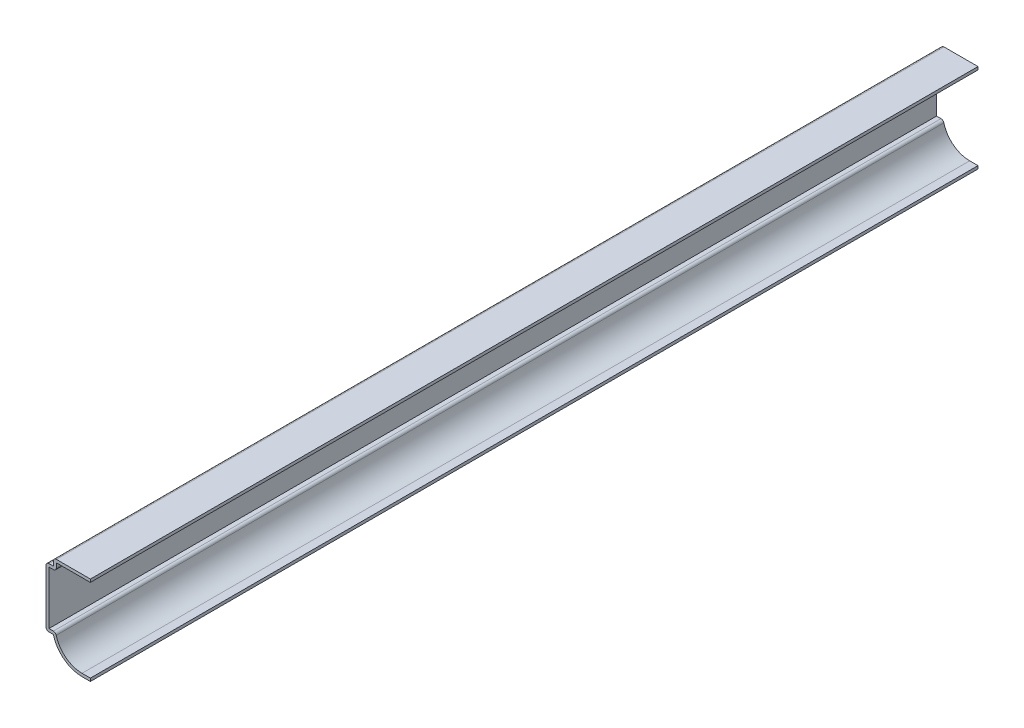
ISO-10303-21;
HEADER;
FILE_DESCRIPTION(('STEP AP214'),'2;1');
FILE_NAME('part.step','',(''),(''),'','','');
FILE_SCHEMA(('AUTOMOTIVE_DESIGN { 1 0 10303 214 1 1 1 1 }'));
ENDSEC;
DATA;
#1=APPLICATION_CONTEXT('core data for automotive mechanical design processes');
#2=APPLICATION_PROTOCOL_DEFINITION('international standard','automotive_design',2000,#1);
#3=PRODUCT_CONTEXT('',#1,'mechanical');
#4=PRODUCT('Part','Part','',(#3));
#5=PRODUCT_RELATED_PRODUCT_CATEGORY('part','',(#4));
#6=PRODUCT_DEFINITION_FORMATION('','',#4);
#7=PRODUCT_DEFINITION_CONTEXT('part definition',#1,'design');
#8=PRODUCT_DEFINITION('design','',#6,#7);
#9=PRODUCT_DEFINITION_SHAPE('','',#8);
#10=(LENGTH_UNIT() NAMED_UNIT(*) SI_UNIT(.MILLI.,.METRE.));
#11=(NAMED_UNIT(*) PLANE_ANGLE_UNIT() SI_UNIT($,.RADIAN.));
#12=(NAMED_UNIT(*) SI_UNIT($,.STERADIAN.) SOLID_ANGLE_UNIT());
#13=UNCERTAINTY_MEASURE_WITH_UNIT(LENGTH_MEASURE(1.E-05),#10,'distance_accuracy_value','');
#14=(GEOMETRIC_REPRESENTATION_CONTEXT(3) GLOBAL_UNCERTAINTY_ASSIGNED_CONTEXT((#13)) GLOBAL_UNIT_ASSIGNED_CONTEXT((#10,
#11,#12)) REPRESENTATION_CONTEXT('',''));
#15=CARTESIAN_POINT('',(0.,0.,0.));
#16=DIRECTION('',(0.,0.,1.));
#17=DIRECTION('',(1.,0.,0.));
#18=AXIS2_PLACEMENT_3D('',#15,#16,#17);
#19=CARTESIAN_POINT('',(-15.875,36.83,-381.));
#20=DIRECTION('',(0.,-1.,0.));
#21=DIRECTION('',(0.,0.,-1.));
#22=AXIS2_PLACEMENT_3D('',#19,#20,#21);
#23=PLANE('',#22);
#24=DIRECTION('',(1.,0.,0.));
#25=VECTOR('',#24,1.);
#26=CARTESIAN_POINT('',(-15.875,36.83,0.));
#27=LINE('',#26,#25);
#28=CARTESIAN_POINT('',(-14.605,36.83,0.));
#29=VERTEX_POINT('',#28);
#30=CARTESIAN_POINT('',(0.,36.83,0.));
#31=VERTEX_POINT('',#30);
#32=EDGE_CURVE('E265',#29,#31,#27,.T.);
#33=ORIENTED_EDGE('',*,*,#32,.F.);
#34=DIRECTION('',(0.,0.,1.));
#35=VECTOR('',#34,1.);
#36=CARTESIAN_POINT('',(-14.605,36.83,-381.));
#37=LINE('',#36,#35);
#38=CARTESIAN_POINT('',(-14.605,36.83,-381.));
#39=VERTEX_POINT('',#38);
#40=EDGE_CURVE('E211',#39,#29,#37,.T.);
#41=ORIENTED_EDGE('',*,*,#40,.F.);
#42=DIRECTION('',(1.,0.,0.));
#43=VECTOR('',#42,1.);
#44=CARTESIAN_POINT('',(-15.875,36.83,-381.));
#45=LINE('',#44,#43);
#46=CARTESIAN_POINT('',(0.,36.83,-381.));
#47=VERTEX_POINT('',#46);
#48=EDGE_CURVE('E190',#39,#47,#45,.T.);
#49=ORIENTED_EDGE('',*,*,#48,.T.);
#50=DIRECTION('',(0.,0.,1.));
#51=VECTOR('',#50,1.);
#52=CARTESIAN_POINT('',(0.,36.83,-381.));
#53=LINE('',#52,#51);
#54=EDGE_CURVE('E198',#47,#31,#53,.T.);
#55=ORIENTED_EDGE('',*,*,#54,.T.);
#56=EDGE_LOOP('',(#33,#41,#49,#55));
#57=FACE_BOUND('',#56,.T.);
#58=ADVANCED_FACE('F41',(#57),#23,.T.);
#59=CARTESIAN_POINT('',(-14.605,34.925,-381.));
#60=DIRECTION('',(1.,0.,0.));
#61=DIRECTION('',(0.,0.,-1.));
#62=AXIS2_PLACEMENT_3D('',#59,#60,#61);
#63=PLANE('',#62);
#64=DIRECTION('',(0.,1.,0.));
#65=VECTOR('',#64,1.);
#66=CARTESIAN_POINT('',(-14.605,34.925,0.));
#67=LINE('',#66,#65);
#68=CARTESIAN_POINT('',(-14.605,34.925,0.));
#69=VERTEX_POINT('',#68);
#70=EDGE_CURVE('E213',#69,#29,#67,.T.);
#71=ORIENTED_EDGE('',*,*,#70,.F.);
#72=DIRECTION('',(0.,0.,1.));
#73=VECTOR('',#72,1.);
#74=CARTESIAN_POINT('',(-14.605,34.925,-381.));
#75=LINE('',#74,#73);
#76=CARTESIAN_POINT('',(-14.605,34.925,-381.));
#77=VERTEX_POINT('',#76);
#78=EDGE_CURVE('E397',#69,#77,#75,.F.);
#79=ORIENTED_EDGE('',*,*,#78,.T.);
#80=DIRECTION('',(0.,1.,0.));
#81=VECTOR('',#80,1.);
#82=CARTESIAN_POINT('',(-14.605,34.925,-381.));
#83=LINE('',#82,#81);
#84=EDGE_CURVE('E207',#77,#39,#83,.T.);
#85=ORIENTED_EDGE('',*,*,#84,.T.);
#86=ORIENTED_EDGE('',*,*,#40,.T.);
#87=EDGE_LOOP('',(#71,#79,#85,#86));
#88=FACE_BOUND('',#87,.T.);
#89=ADVANCED_FACE('F416',(#88),#63,.T.);
#90=CARTESIAN_POINT('',(-19.05,33.655,-381.));
#91=DIRECTION('',(0.,-1.,0.));
#92=DIRECTION('',(0.,0.,-1.));
#93=AXIS2_PLACEMENT_3D('',#90,#91,#92);
#94=PLANE('',#93);
#95=DIRECTION('',(1.,0.,0.));
#96=VECTOR('',#95,1.);
#97=CARTESIAN_POINT('',(-19.05,33.655,-381.));
#98=LINE('',#97,#96);
#99=CARTESIAN_POINT('',(-17.78,33.655,-381.));
#100=VERTEX_POINT('',#99);
#101=CARTESIAN_POINT('',(-15.875,33.655,-381.));
#102=VERTEX_POINT('',#101);
#103=EDGE_CURVE('E259',#100,#102,#98,.T.);
#104=ORIENTED_EDGE('',*,*,#103,.T.);
#105=DIRECTION('',(0.,0.,1.));
#106=VECTOR('',#105,1.);
#107=CARTESIAN_POINT('',(-15.875,33.655,-381.));
#108=LINE('',#107,#106);
#109=CARTESIAN_POINT('',(-15.875,33.655,0.));
#110=VERTEX_POINT('',#109);
#111=EDGE_CURVE('E393',#102,#110,#108,.T.);
#112=ORIENTED_EDGE('',*,*,#111,.T.);
#113=DIRECTION('',(1.,0.,0.));
#114=VECTOR('',#113,1.);
#115=CARTESIAN_POINT('',(-19.05,33.655,0.));
#116=LINE('',#115,#114);
#117=CARTESIAN_POINT('',(-17.78,33.655,0.));
#118=VERTEX_POINT('',#117);
#119=EDGE_CURVE('E216',#118,#110,#116,.T.);
#120=ORIENTED_EDGE('',*,*,#119,.F.);
#121=DIRECTION('',(0.,0.,1.));
#122=VECTOR('',#121,1.);
#123=CARTESIAN_POINT('',(-17.78,33.655,-381.));
#124=LINE('',#123,#122);
#125=EDGE_CURVE('E317',#100,#118,#124,.T.);
#126=ORIENTED_EDGE('',*,*,#125,.F.);
#127=EDGE_LOOP('',(#104,#112,#120,#126));
#128=FACE_BOUND('',#127,.T.);
#129=ADVANCED_FACE('F424',(#128),#94,.T.);
#130=CARTESIAN_POINT('',(-17.78,9.525,-381.));
#131=DIRECTION('',(1.,0.,0.));
#132=DIRECTION('',(0.,0.,-1.));
#133=AXIS2_PLACEMENT_3D('',#130,#131,#132);
#134=PLANE('',#133);
#135=DIRECTION('',(0.,1.,0.));
#136=VECTOR('',#135,1.);
#137=CARTESIAN_POINT('',(-17.78,9.525,0.));
#138=LINE('',#137,#136);
#139=CARTESIAN_POINT('',(-17.78,10.795,0.));
#140=VERTEX_POINT('',#139);
#141=EDGE_CURVE('E307',#140,#118,#138,.T.);
#142=ORIENTED_EDGE('',*,*,#141,.F.);
#143=DIRECTION('',(0.,0.,1.));
#144=VECTOR('',#143,1.);
#145=CARTESIAN_POINT('',(-17.78,10.795,-381.));
#146=LINE('',#145,#144);
#147=CARTESIAN_POINT('',(-17.78,10.795,-381.));
#148=VERTEX_POINT('',#147);
#149=EDGE_CURVE('E320',#148,#140,#146,.T.);
#150=ORIENTED_EDGE('',*,*,#149,.F.);
#151=DIRECTION('',(0.,1.,0.));
#152=VECTOR('',#151,1.);
#153=CARTESIAN_POINT('',(-17.78,9.525,-381.));
#154=LINE('',#153,#152);
#155=EDGE_CURVE('E255',#148,#100,#154,.T.);
#156=ORIENTED_EDGE('',*,*,#155,.T.);
#157=ORIENTED_EDGE('',*,*,#125,.T.);
#158=EDGE_LOOP('',(#142,#150,#156,#157));
#159=FACE_BOUND('',#158,.T.);
#160=ADVANCED_FACE('F429',(#159),#134,.T.);
#161=CARTESIAN_POINT('',(-15.875,10.795,-381.));
#162=DIRECTION('',(0.,1.,0.));
#163=DIRECTION('',(0.,0.,1.));
#164=AXIS2_PLACEMENT_3D('',#161,#162,#163);
#165=PLANE('',#164);
#166=DIRECTION('',(1.,0.,0.));
#167=VECTOR('',#166,1.);
#168=CARTESIAN_POINT('',(-15.875,10.795,0.));
#169=LINE('',#168,#167);
#170=CARTESIAN_POINT('',(-15.875,10.795,0.));
#171=VERTEX_POINT('',#170);
#172=EDGE_CURVE('E304',#171,#140,#169,.F.);
#173=ORIENTED_EDGE('',*,*,#172,.F.);
#174=DIRECTION('',(0.,0.,1.));
#175=VECTOR('',#174,1.);
#176=CARTESIAN_POINT('',(-15.875,10.795,-381.));
#177=LINE('',#176,#175);
#178=CARTESIAN_POINT('',(-15.875,10.795,-381.));
#179=VERTEX_POINT('',#178);
#180=EDGE_CURVE('E366',#171,#179,#177,.F.);
#181=ORIENTED_EDGE('',*,*,#180,.T.);
#182=DIRECTION('',(1.,0.,0.));
#183=VECTOR('',#182,1.);
#184=CARTESIAN_POINT('',(-15.875,10.795,-381.));
#185=LINE('',#184,#183);
#186=EDGE_CURVE('E252',#179,#148,#185,.F.);
#187=ORIENTED_EDGE('',*,*,#186,.T.);
#188=ORIENTED_EDGE('',*,*,#149,.T.);
#189=EDGE_LOOP('',(#173,#181,#187,#188));
#190=FACE_BOUND('',#189,.T.);
#191=ADVANCED_FACE('F620',(#190),#165,.T.);
#192=CARTESIAN_POINT('',(-3.57827787579145,12.7,-381.));
#193=DIRECTION('',(0.,0.,1.));
#194=DIRECTION('',(1.,0.,0.));
#195=AXIS2_PLACEMENT_3D('',#192,#193,#194);
#196=CYLINDRICAL_SURFACE('',#195,11.43);
#197=CARTESIAN_POINT('',(-3.57827787579145,12.7,-381.));
#198=DIRECTION('',(0.,0.,1.));
#199=DIRECTION('',(1.,0.,0.));
#200=AXIS2_PLACEMENT_3D('',#197,#198,#199);
#201=CIRCLE('',#200,11.43);
#202=CARTESIAN_POINT('',(-3.57827787579145,1.27,-381.));
#203=VERTEX_POINT('',#202);
#204=CARTESIAN_POINT('',(-14.6453277875791,9.8425,-381.));
#205=VERTEX_POINT('',#204);
#206=EDGE_CURVE('E248',#203,#205,#201,.F.);
#207=ORIENTED_EDGE('',*,*,#206,.T.);
#208=DIRECTION('',(0.,0.,1.));
#209=VECTOR('',#208,1.);
#210=CARTESIAN_POINT('',(-14.6453277875791,9.8425,-381.));
#211=LINE('',#210,#209);
#212=CARTESIAN_POINT('',(-14.6453277875791,9.8425,0.));
#213=VERTEX_POINT('',#212);
#214=EDGE_CURVE('E316',#205,#213,#211,.T.);
#215=ORIENTED_EDGE('',*,*,#214,.T.);
#216=CARTESIAN_POINT('',(-3.57827787579145,12.7,0.));
#217=DIRECTION('',(0.,0.,1.));
#218=DIRECTION('',(1.,0.,0.));
#219=AXIS2_PLACEMENT_3D('',#216,#217,#218);
#220=CIRCLE('',#219,11.43);
#221=CARTESIAN_POINT('',(-3.57827787579145,1.27,0.));
#222=VERTEX_POINT('',#221);
#223=EDGE_CURVE('E300',#222,#213,#220,.F.);
#224=ORIENTED_EDGE('',*,*,#223,.F.);
#225=DIRECTION('',(0.,0.,1.));
#226=VECTOR('',#225,1.);
#227=CARTESIAN_POINT('',(-3.57827787579145,1.27,-381.));
#228=LINE('',#227,#226);
#229=EDGE_CURVE('E324',#203,#222,#228,.T.);
#230=ORIENTED_EDGE('',*,*,#229,.F.);
#231=EDGE_LOOP('',(#207,#215,#224,#230));
#232=FACE_BOUND('',#231,.T.);
#233=ADVANCED_FACE('F440',(#232),#196,.F.);
#234=CARTESIAN_POINT('',(0.,1.27,-381.));
#235=DIRECTION('',(0.,1.,0.));
#236=DIRECTION('',(0.,0.,1.));
#237=AXIS2_PLACEMENT_3D('',#234,#235,#236);
#238=PLANE('',#237);
#239=DIRECTION('',(1.,0.,0.));
#240=VECTOR('',#239,1.);
#241=CARTESIAN_POINT('',(0.,1.27,0.));
#242=LINE('',#241,#240);
#243=CARTESIAN_POINT('',(0.,1.27,0.));
#244=VERTEX_POINT('',#243);
#245=EDGE_CURVE('E296',#244,#222,#242,.F.);
#246=ORIENTED_EDGE('',*,*,#245,.F.);
#247=DIRECTION('',(0.,0.,1.));
#248=VECTOR('',#247,1.);
#249=CARTESIAN_POINT('',(0.,1.27,-381.));
#250=LINE('',#249,#248);
#251=CARTESIAN_POINT('',(0.,1.27,-381.));
#252=VERTEX_POINT('',#251);
#253=EDGE_CURVE('E327',#252,#244,#250,.T.);
#254=ORIENTED_EDGE('',*,*,#253,.F.);
#255=DIRECTION('',(1.,0.,0.));
#256=VECTOR('',#255,1.);
#257=CARTESIAN_POINT('',(0.,1.27,-381.));
#258=LINE('',#257,#256);
#259=EDGE_CURVE('E244',#252,#203,#258,.F.);
#260=ORIENTED_EDGE('',*,*,#259,.T.);
#261=ORIENTED_EDGE('',*,*,#229,.T.);
#262=EDGE_LOOP('',(#246,#254,#260,#261));
#263=FACE_BOUND('',#262,.T.);
#264=ADVANCED_FACE('F445',(#263),#238,.T.);
#265=CARTESIAN_POINT('',(0.,1.27,-381.));
#266=DIRECTION('',(-1.,0.,0.));
#267=DIRECTION('',(0.,0.,1.));
#268=AXIS2_PLACEMENT_3D('',#265,#266,#267);
#269=PLANE('',#268);
#270=DIRECTION('',(0.,-1.,0.));
#271=VECTOR('',#270,1.);
#272=CARTESIAN_POINT('',(0.,1.27,0.));
#273=LINE('',#272,#271);
#274=CARTESIAN_POINT('',(0.,0.,0.));
#275=VERTEX_POINT('',#274);
#276=EDGE_CURVE('E293',#244,#275,#273,.T.);
#277=ORIENTED_EDGE('',*,*,#276,.T.);
#278=DIRECTION('',(0.,0.,1.));
#279=VECTOR('',#278,1.);
#280=CARTESIAN_POINT('',(0.,0.,-381.));
#281=LINE('',#280,#279);
#282=CARTESIAN_POINT('',(0.,0.,-381.));
#283=VERTEX_POINT('',#282);
#284=EDGE_CURVE('E330',#283,#275,#281,.T.);
#285=ORIENTED_EDGE('',*,*,#284,.F.);
#286=DIRECTION('',(0.,-1.,0.));
#287=VECTOR('',#286,1.);
#288=CARTESIAN_POINT('',(0.,1.27,-381.));
#289=LINE('',#288,#287);
#290=EDGE_CURVE('E241',#252,#283,#289,.T.);
#291=ORIENTED_EDGE('',*,*,#290,.F.);
#292=ORIENTED_EDGE('',*,*,#253,.T.);
#293=EDGE_LOOP('',(#277,#285,#291,#292));
#294=FACE_BOUND('',#293,.T.);
#295=ADVANCED_FACE('F452',(#294),#269,.F.);
#296=CARTESIAN_POINT('',(0.,0.,-381.));
#297=DIRECTION('',(0.,1.,0.));
#298=DIRECTION('',(0.,0.,1.));
#299=AXIS2_PLACEMENT_3D('',#296,#297,#298);
#300=PLANE('',#299);
#301=DIRECTION('',(-1.,0.,0.));
#302=VECTOR('',#301,1.);
#303=CARTESIAN_POINT('',(0.,0.,0.));
#304=LINE('',#303,#302);
#305=CARTESIAN_POINT('',(-3.57827787579145,0.,0.));
#306=VERTEX_POINT('',#305);
#307=EDGE_CURVE('E290',#275,#306,#304,.T.);
#308=ORIENTED_EDGE('',*,*,#307,.T.);
#309=DIRECTION('',(0.,0.,1.));
#310=VECTOR('',#309,1.);
#311=CARTESIAN_POINT('',(-3.57827787579145,0.,-381.));
#312=LINE('',#311,#310);
#313=CARTESIAN_POINT('',(-3.57827787579145,0.,-381.));
#314=VERTEX_POINT('',#313);
#315=EDGE_CURVE('E334',#314,#306,#312,.T.);
#316=ORIENTED_EDGE('',*,*,#315,.F.);
#317=DIRECTION('',(-1.,0.,0.));
#318=VECTOR('',#317,1.);
#319=CARTESIAN_POINT('',(0.,0.,-381.));
#320=LINE('',#319,#318);
#321=EDGE_CURVE('E238',#283,#314,#320,.T.);
#322=ORIENTED_EDGE('',*,*,#321,.F.);
#323=ORIENTED_EDGE('',*,*,#284,.T.);
#324=EDGE_LOOP('',(#308,#316,#322,#323));
#325=FACE_BOUND('',#324,.T.);
#326=ADVANCED_FACE('F454',(#325),#300,.F.);
#327=CARTESIAN_POINT('',(-3.57827787579145,12.7,-381.));
#328=DIRECTION('',(0.,0.,1.));
#329=DIRECTION('',(1.,0.,0.));
#330=AXIS2_PLACEMENT_3D('',#327,#328,#329);
#331=CYLINDRICAL_SURFACE('',#330,12.7);
#332=CARTESIAN_POINT('',(-3.57827787579145,12.7,0.));
#333=DIRECTION('',(0.,0.,-1.));
#334=DIRECTION('',(-1.,0.,0.));
#335=AXIS2_PLACEMENT_3D('',#332,#333,#334);
#336=CIRCLE('',#335,12.7);
#337=CARTESIAN_POINT('',(-15.875,9.525,0.));
#338=VERTEX_POINT('',#337);
#339=EDGE_CURVE('E287',#306,#338,#336,.T.);
#340=ORIENTED_EDGE('',*,*,#339,.T.);
#341=DIRECTION('',(0.,0.,1.));
#342=VECTOR('',#341,1.);
#343=CARTESIAN_POINT('',(-15.875,9.525,-381.));
#344=LINE('',#343,#342);
#345=CARTESIAN_POINT('',(-15.875,9.525,-381.));
#346=VERTEX_POINT('',#345);
#347=EDGE_CURVE('E338',#346,#338,#344,.T.);
#348=ORIENTED_EDGE('',*,*,#347,.F.);
#349=CARTESIAN_POINT('',(-3.57827787579145,12.7,-381.));
#350=DIRECTION('',(0.,0.,-1.));
#351=DIRECTION('',(-1.,0.,0.));
#352=AXIS2_PLACEMENT_3D('',#349,#350,#351);
#353=CIRCLE('',#352,12.7);
#354=EDGE_CURVE('E235',#314,#346,#353,.T.);
#355=ORIENTED_EDGE('',*,*,#354,.F.);
#356=ORIENTED_EDGE('',*,*,#315,.T.);
#357=EDGE_LOOP('',(#340,#348,#355,#356));
#358=FACE_BOUND('',#357,.T.);
#359=ADVANCED_FACE('F459',(#358),#331,.T.);
#360=CARTESIAN_POINT('',(-15.875,9.525,-381.));
#361=DIRECTION('',(0.,1.,0.));
#362=DIRECTION('',(0.,0.,1.));
#363=AXIS2_PLACEMENT_3D('',#360,#361,#362);
#364=PLANE('',#363);
#365=DIRECTION('',(-1.,0.,0.));
#366=VECTOR('',#365,1.);
#367=CARTESIAN_POINT('',(-15.875,9.525,0.));
#368=LINE('',#367,#366);
#369=CARTESIAN_POINT('',(-17.78,9.525,0.));
#370=VERTEX_POINT('',#369);
#371=EDGE_CURVE('E283',#338,#370,#368,.T.);
#372=ORIENTED_EDGE('',*,*,#371,.T.);
#373=DIRECTION('',(0.,0.,1.));
#374=VECTOR('',#373,1.);
#375=CARTESIAN_POINT('',(-17.78,9.525,-381.));
#376=LINE('',#375,#374);
#377=CARTESIAN_POINT('',(-17.78,9.525,-381.));
#378=VERTEX_POINT('',#377);
#379=EDGE_CURVE('E390',#370,#378,#376,.F.);
#380=ORIENTED_EDGE('',*,*,#379,.T.);
#381=DIRECTION('',(-1.,0.,0.));
#382=VECTOR('',#381,1.);
#383=CARTESIAN_POINT('',(-15.875,9.525,-381.));
#384=LINE('',#383,#382);
#385=EDGE_CURVE('E231',#346,#378,#384,.T.);
#386=ORIENTED_EDGE('',*,*,#385,.F.);
#387=ORIENTED_EDGE('',*,*,#347,.T.);
#388=EDGE_LOOP('',(#372,#380,#386,#387));
#389=FACE_BOUND('',#388,.T.);
#390=ADVANCED_FACE('F577',(#389),#364,.F.);
#391=CARTESIAN_POINT('',(-19.05,9.525,-381.));
#392=DIRECTION('',(1.,0.,0.));
#393=DIRECTION('',(0.,0.,-1.));
#394=AXIS2_PLACEMENT_3D('',#391,#392,#393);
#395=PLANE('',#394);
#396=DIRECTION('',(0.,1.,0.));
#397=VECTOR('',#396,1.);
#398=CARTESIAN_POINT('',(-19.05,9.525,-381.));
#399=LINE('',#398,#397);
#400=CARTESIAN_POINT('',(-19.05,10.795,-381.));
#401=VERTEX_POINT('',#400);
#402=CARTESIAN_POINT('',(-19.05,33.655,-381.));
#403=VERTEX_POINT('',#402);
#404=EDGE_CURVE('E227',#401,#403,#399,.T.);
#405=ORIENTED_EDGE('',*,*,#404,.F.);
#406=DIRECTION('',(0.,0.,1.));
#407=VECTOR('',#406,1.);
#408=CARTESIAN_POINT('',(-19.05,10.795,-381.));
#409=LINE('',#408,#407);
#410=CARTESIAN_POINT('',(-19.05,10.795,0.));
#411=VERTEX_POINT('',#410);
#412=EDGE_CURVE('E386',#401,#411,#409,.T.);
#413=ORIENTED_EDGE('',*,*,#412,.T.);
#414=DIRECTION('',(0.,1.,0.));
#415=VECTOR('',#414,1.);
#416=CARTESIAN_POINT('',(-19.05,9.525,0.));
#417=LINE('',#416,#415);
#418=CARTESIAN_POINT('',(-19.05,33.655,0.));
#419=VERTEX_POINT('',#418);
#420=EDGE_CURVE('E279',#411,#419,#417,.T.);
#421=ORIENTED_EDGE('',*,*,#420,.T.);
#422=DIRECTION('',(0.,0.,1.));
#423=VECTOR('',#422,1.);
#424=CARTESIAN_POINT('',(-19.05,33.655,-381.));
#425=LINE('',#424,#423);
#426=EDGE_CURVE('E383',#419,#403,#425,.F.);
#427=ORIENTED_EDGE('',*,*,#426,.T.);
#428=EDGE_LOOP('',(#405,#413,#421,#427));
#429=FACE_BOUND('',#428,.T.);
#430=ADVANCED_FACE('F470',(#429),#395,.F.);
#431=CARTESIAN_POINT('',(-19.05,34.925,-381.));
#432=DIRECTION('',(0.,-1.,0.));
#433=DIRECTION('',(0.,0.,-1.));
#434=AXIS2_PLACEMENT_3D('',#431,#432,#433);
#435=PLANE('',#434);
#436=DIRECTION('',(1.,0.,0.));
#437=VECTOR('',#436,1.);
#438=CARTESIAN_POINT('',(-19.05,34.925,-381.));
#439=LINE('',#438,#437);
#440=CARTESIAN_POINT('',(-17.78,34.925,-381.));
#441=VERTEX_POINT('',#440);
#442=CARTESIAN_POINT('',(-15.875,34.925,-381.));
#443=VERTEX_POINT('',#442);
#444=EDGE_CURVE('E224',#441,#443,#439,.T.);
#445=ORIENTED_EDGE('',*,*,#444,.F.);
#446=DIRECTION('',(0.,0.,1.));
#447=VECTOR('',#446,1.);
#448=CARTESIAN_POINT('',(-17.78,34.925,-381.));
#449=LINE('',#448,#447);
#450=CARTESIAN_POINT('',(-17.78,34.925,0.));
#451=VERTEX_POINT('',#450);
#452=EDGE_CURVE('E400',#441,#451,#449,.T.);
#453=ORIENTED_EDGE('',*,*,#452,.T.);
#454=DIRECTION('',(1.,0.,0.));
#455=VECTOR('',#454,1.);
#456=CARTESIAN_POINT('',(-19.05,34.925,0.));
#457=LINE('',#456,#455);
#458=CARTESIAN_POINT('',(-15.875,34.925,0.));
#459=VERTEX_POINT('',#458);
#460=EDGE_CURVE('E276',#451,#459,#457,.T.);
#461=ORIENTED_EDGE('',*,*,#460,.T.);
#462=DIRECTION('',(0.,0.,1.));
#463=VECTOR('',#462,1.);
#464=CARTESIAN_POINT('',(-15.875,34.925,-381.));
#465=LINE('',#464,#463);
#466=EDGE_CURVE('E342',#443,#459,#465,.T.);
#467=ORIENTED_EDGE('',*,*,#466,.F.);
#468=EDGE_LOOP('',(#445,#453,#461,#467));
#469=FACE_BOUND('',#468,.T.);
#470=ADVANCED_FACE('F480',(#469),#435,.F.);
#471=CARTESIAN_POINT('',(-15.875,34.925,-381.));
#472=DIRECTION('',(1.,0.,0.));
#473=DIRECTION('',(0.,0.,-1.));
#474=AXIS2_PLACEMENT_3D('',#471,#472,#473);
#475=PLANE('',#474);
#476=DIRECTION('',(0.,1.,0.));
#477=VECTOR('',#476,1.);
#478=CARTESIAN_POINT('',(-15.875,34.925,0.));
#479=LINE('',#478,#477);
#480=CARTESIAN_POINT('',(-15.875,36.83,0.));
#481=VERTEX_POINT('',#480);
#482=EDGE_CURVE('E273',#459,#481,#479,.T.);
#483=ORIENTED_EDGE('',*,*,#482,.T.);
#484=DIRECTION('',(0.,0.,1.));
#485=VECTOR('',#484,1.);
#486=CARTESIAN_POINT('',(-15.875,36.83,-381.));
#487=LINE('',#486,#485);
#488=CARTESIAN_POINT('',(-15.875,36.83,-381.));
#489=VERTEX_POINT('',#488);
#490=EDGE_CURVE('E11',#481,#489,#487,.F.);
#491=ORIENTED_EDGE('',*,*,#490,.T.);
#492=DIRECTION('',(0.,1.,0.));
#493=VECTOR('',#492,1.);
#494=CARTESIAN_POINT('',(-15.875,34.925,-381.));
#495=LINE('',#494,#493);
#496=EDGE_CURVE('E221',#443,#489,#495,.T.);
#497=ORIENTED_EDGE('',*,*,#496,.F.);
#498=ORIENTED_EDGE('',*,*,#466,.T.);
#499=EDGE_LOOP('',(#483,#491,#497,#498));
#500=FACE_BOUND('',#499,.T.);
#501=ADVANCED_FACE('F556',(#500),#475,.F.);
#502=CARTESIAN_POINT('',(-15.875,38.1,-381.));
#503=DIRECTION('',(0.,-1.,0.));
#504=DIRECTION('',(0.,0.,-1.));
#505=AXIS2_PLACEMENT_3D('',#502,#503,#504);
#506=PLANE('',#505);
#507=DIRECTION('',(1.,0.,0.));
#508=VECTOR('',#507,1.);
#509=CARTESIAN_POINT('',(-15.875,38.1,-381.));
#510=LINE('',#509,#508);
#511=CARTESIAN_POINT('',(-14.605,38.1,-381.));
#512=VERTEX_POINT('',#511);
#513=CARTESIAN_POINT('',(0.,38.1,-381.));
#514=VERTEX_POINT('',#513);
#515=EDGE_CURVE('E191',#512,#514,#510,.T.);
#516=ORIENTED_EDGE('',*,*,#515,.F.);
#517=DIRECTION('',(0.,0.,1.));
#518=VECTOR('',#517,1.);
#519=CARTESIAN_POINT('',(-14.605,38.1,-381.));
#520=LINE('',#519,#518);
#521=CARTESIAN_POINT('',(-14.605,38.1,0.));
#522=VERTEX_POINT('',#521);
#523=EDGE_CURVE('E50',#512,#522,#520,.T.);
#524=ORIENTED_EDGE('',*,*,#523,.T.);
#525=DIRECTION('',(1.,0.,0.));
#526=VECTOR('',#525,1.);
#527=CARTESIAN_POINT('',(-15.875,38.1,0.));
#528=LINE('',#527,#526);
#529=CARTESIAN_POINT('',(0.,38.1,0.));
#530=VERTEX_POINT('',#529);
#531=EDGE_CURVE('E270',#522,#530,#528,.T.);
#532=ORIENTED_EDGE('',*,*,#531,.T.);
#533=DIRECTION('',(0.,0.,1.));
#534=VECTOR('',#533,1.);
#535=CARTESIAN_POINT('',(0.,38.1,-381.));
#536=LINE('',#535,#534);
#537=EDGE_CURVE('E206',#514,#530,#536,.T.);
#538=ORIENTED_EDGE('',*,*,#537,.F.);
#539=EDGE_LOOP('',(#516,#524,#532,#538));
#540=FACE_BOUND('',#539,.T.);
#541=ADVANCED_FACE('F408',(#540),#506,.F.);
#542=CARTESIAN_POINT('',(0.,38.1,-381.));
#543=DIRECTION('',(-1.,0.,0.));
#544=DIRECTION('',(0.,0.,1.));
#545=AXIS2_PLACEMENT_3D('',#542,#543,#544);
#546=PLANE('',#545);
#547=DIRECTION('',(0.,-1.,0.));
#548=VECTOR('',#547,1.);
#549=CARTESIAN_POINT('',(0.,38.1,0.));
#550=LINE('',#549,#548);
#551=EDGE_CURVE('E201',#530,#31,#550,.T.);
#552=ORIENTED_EDGE('',*,*,#551,.T.);
#553=ORIENTED_EDGE('',*,*,#54,.F.);
#554=DIRECTION('',(0.,-1.,0.));
#555=VECTOR('',#554,1.);
#556=CARTESIAN_POINT('',(0.,38.1,-381.));
#557=LINE('',#556,#555);
#558=EDGE_CURVE('E184',#514,#47,#557,.T.);
#559=ORIENTED_EDGE('',*,*,#558,.F.);
#560=ORIENTED_EDGE('',*,*,#537,.T.);
#561=EDGE_LOOP('',(#552,#553,#559,#560));
#562=FACE_BOUND('',#561,.T.);
#563=ADVANCED_FACE('F199',(#562),#546,.F.);
#564=CARTESIAN_POINT('',(-3.57827787579145,12.7,-381.));
#565=DIRECTION('',(0.,0.,-1.));
#566=DIRECTION('',(-1.,0.,0.));
#567=AXIS2_PLACEMENT_3D('',#564,#565,#566);
#568=PLANE('',#567);
#569=ORIENTED_EDGE('',*,*,#186,.F.);
#570=CARTESIAN_POINT('',(-15.875,9.525,-381.));
#571=DIRECTION('',(0.,0.,-1.));
#572=DIRECTION('',(-1.,0.,0.));
#573=AXIS2_PLACEMENT_3D('',#570,#571,#572);
#574=CIRCLE('',#573,1.27);
#575=EDGE_CURVE('E380',#179,#205,#574,.T.);
#576=ORIENTED_EDGE('',*,*,#575,.T.);
#577=ORIENTED_EDGE('',*,*,#206,.F.);
#578=ORIENTED_EDGE('',*,*,#259,.F.);
#579=ORIENTED_EDGE('',*,*,#290,.T.);
#580=ORIENTED_EDGE('',*,*,#321,.T.);
#581=ORIENTED_EDGE('',*,*,#354,.T.);
#582=ORIENTED_EDGE('',*,*,#385,.T.);
#583=CARTESIAN_POINT('',(-17.78,10.795,-381.));
#584=DIRECTION('',(0.,0.,-1.));
#585=DIRECTION('',(-1.,0.,0.));
#586=AXIS2_PLACEMENT_3D('',#583,#584,#585);
#587=CIRCLE('',#586,1.27);
#588=EDGE_CURVE('E377',#378,#401,#587,.T.);
#589=ORIENTED_EDGE('',*,*,#588,.T.);
#590=ORIENTED_EDGE('',*,*,#404,.T.);
#591=CARTESIAN_POINT('',(-17.78,33.655,-381.));
#592=DIRECTION('',(0.,0.,-1.));
#593=DIRECTION('',(-1.,0.,0.));
#594=AXIS2_PLACEMENT_3D('',#591,#592,#593);
#595=CIRCLE('',#594,1.27);
#596=EDGE_CURVE('E371',#403,#441,#595,.T.);
#597=ORIENTED_EDGE('',*,*,#596,.T.);
#598=ORIENTED_EDGE('',*,*,#444,.T.);
#599=ORIENTED_EDGE('',*,*,#496,.T.);
#600=CARTESIAN_POINT('',(-14.605,36.83,-381.));
#601=DIRECTION('',(0.,0.,-1.));
#602=DIRECTION('',(-1.,0.,0.));
#603=AXIS2_PLACEMENT_3D('',#600,#601,#602);
#604=CIRCLE('',#603,1.27);
#605=EDGE_CURVE('E57',#489,#512,#604,.T.);
#606=ORIENTED_EDGE('',*,*,#605,.T.);
#607=ORIENTED_EDGE('',*,*,#515,.T.);
#608=ORIENTED_EDGE('',*,*,#558,.T.);
#609=ORIENTED_EDGE('',*,*,#48,.F.);
#610=ORIENTED_EDGE('',*,*,#84,.F.);
#611=CARTESIAN_POINT('',(-15.875,34.925,-381.));
#612=DIRECTION('',(0.,0.,-1.));
#613=DIRECTION('',(-1.,0.,0.));
#614=AXIS2_PLACEMENT_3D('',#611,#612,#613);
#615=CIRCLE('',#614,1.27);
#616=EDGE_CURVE('E374',#77,#102,#615,.T.);
#617=ORIENTED_EDGE('',*,*,#616,.T.);
#618=ORIENTED_EDGE('',*,*,#103,.F.);
#619=ORIENTED_EDGE('',*,*,#155,.F.);
#620=EDGE_LOOP('',(#569,#576,#577,#578,#579,#580,#581,#582,#589,#590,#597,#598,#599,#606,#607,
#608,#609,#610,#617,#618,#619));
#621=FACE_BOUND('',#620,.T.);
#622=ADVANCED_FACE('F187',(#621),#568,.T.);
#623=CARTESIAN_POINT('',(-3.57827787579145,12.7,0.));
#624=DIRECTION('',(0.,0.,-1.));
#625=DIRECTION('',(-1.,0.,0.));
#626=AXIS2_PLACEMENT_3D('',#623,#624,#625);
#627=PLANE('',#626);
#628=ORIENTED_EDGE('',*,*,#223,.T.);
#629=CARTESIAN_POINT('',(-15.875,9.525,0.));
#630=DIRECTION('',(0.,0.,-1.));
#631=DIRECTION('',(-1.,0.,0.));
#632=AXIS2_PLACEMENT_3D('',#629,#630,#631);
#633=CIRCLE('',#632,1.27);
#634=EDGE_CURVE('E363',#213,#171,#633,.F.);
#635=ORIENTED_EDGE('',*,*,#634,.T.);
#636=ORIENTED_EDGE('',*,*,#172,.T.);
#637=ORIENTED_EDGE('',*,*,#141,.T.);
#638=ORIENTED_EDGE('',*,*,#119,.T.);
#639=CARTESIAN_POINT('',(-15.875,34.925,0.));
#640=DIRECTION('',(0.,0.,-1.));
#641=DIRECTION('',(-1.,0.,0.));
#642=AXIS2_PLACEMENT_3D('',#639,#640,#641);
#643=CIRCLE('',#642,1.27);
#644=EDGE_CURVE('E357',#110,#69,#643,.F.);
#645=ORIENTED_EDGE('',*,*,#644,.T.);
#646=ORIENTED_EDGE('',*,*,#70,.T.);
#647=ORIENTED_EDGE('',*,*,#32,.T.);
#648=ORIENTED_EDGE('',*,*,#551,.F.);
#649=ORIENTED_EDGE('',*,*,#531,.F.);
#650=CARTESIAN_POINT('',(-14.605,36.83,0.));
#651=DIRECTION('',(0.,0.,-1.));
#652=DIRECTION('',(-1.,0.,0.));
#653=AXIS2_PLACEMENT_3D('',#650,#651,#652);
#654=CIRCLE('',#653,1.27);
#655=EDGE_CURVE('E351',#522,#481,#654,.F.);
#656=ORIENTED_EDGE('',*,*,#655,.T.);
#657=ORIENTED_EDGE('',*,*,#482,.F.);
#658=ORIENTED_EDGE('',*,*,#460,.F.);
#659=CARTESIAN_POINT('',(-17.78,33.655,0.));
#660=DIRECTION('',(0.,0.,-1.));
#661=DIRECTION('',(-1.,0.,0.));
#662=AXIS2_PLACEMENT_3D('',#659,#660,#661);
#663=CIRCLE('',#662,1.27);
#664=EDGE_CURVE('E354',#451,#419,#663,.F.);
#665=ORIENTED_EDGE('',*,*,#664,.T.);
#666=ORIENTED_EDGE('',*,*,#420,.F.);
#667=CARTESIAN_POINT('',(-17.78,10.795,0.));
#668=DIRECTION('',(0.,0.,-1.));
#669=DIRECTION('',(-1.,0.,0.));
#670=AXIS2_PLACEMENT_3D('',#667,#668,#669);
#671=CIRCLE('',#670,1.27);
#672=EDGE_CURVE('E360',#411,#370,#671,.F.);
#673=ORIENTED_EDGE('',*,*,#672,.T.);
#674=ORIENTED_EDGE('',*,*,#371,.F.);
#675=ORIENTED_EDGE('',*,*,#339,.F.);
#676=ORIENTED_EDGE('',*,*,#307,.F.);
#677=ORIENTED_EDGE('',*,*,#276,.F.);
#678=ORIENTED_EDGE('',*,*,#245,.T.);
#679=EDGE_LOOP('',(#628,#635,#636,#637,#638,#645,#646,#647,#648,#649,#656,#657,#658,#665,#666,
#673,#674,#675,#676,#677,#678));
#680=FACE_BOUND('',#679,.T.);
#681=ADVANCED_FACE('F411',(#680),#627,.F.);
#682=CARTESIAN_POINT('',(-15.875,9.525,-381.));
#683=DIRECTION('',(0.,0.,1.));
#684=DIRECTION('',(1.,0.,0.));
#685=AXIS2_PLACEMENT_3D('',#682,#683,#684);
#686=CYLINDRICAL_SURFACE('',#685,1.27);
#687=ORIENTED_EDGE('',*,*,#575,.F.);
#688=ORIENTED_EDGE('',*,*,#180,.F.);
#689=ORIENTED_EDGE('',*,*,#634,.F.);
#690=ORIENTED_EDGE('',*,*,#214,.F.);
#691=EDGE_LOOP('',(#687,#688,#689,#690));
#692=FACE_BOUND('',#691,.T.);
#693=ADVANCED_FACE('F437',(#692),#686,.T.);
#694=CARTESIAN_POINT('',(-17.78,10.795,-381.));
#695=DIRECTION('',(0.,0.,1.));
#696=DIRECTION('',(1.,0.,0.));
#697=AXIS2_PLACEMENT_3D('',#694,#695,#696);
#698=CYLINDRICAL_SURFACE('',#697,1.27);
#699=ORIENTED_EDGE('',*,*,#588,.F.);
#700=ORIENTED_EDGE('',*,*,#379,.F.);
#701=ORIENTED_EDGE('',*,*,#672,.F.);
#702=ORIENTED_EDGE('',*,*,#412,.F.);
#703=EDGE_LOOP('',(#699,#700,#701,#702));
#704=FACE_BOUND('',#703,.T.);
#705=ADVANCED_FACE('F467',(#704),#698,.T.);
#706=CARTESIAN_POINT('',(-15.875,34.925,-381.));
#707=DIRECTION('',(0.,0.,1.));
#708=DIRECTION('',(1.,0.,0.));
#709=AXIS2_PLACEMENT_3D('',#706,#707,#708);
#710=CYLINDRICAL_SURFACE('',#709,1.27);
#711=ORIENTED_EDGE('',*,*,#616,.F.);
#712=ORIENTED_EDGE('',*,*,#78,.F.);
#713=ORIENTED_EDGE('',*,*,#644,.F.);
#714=ORIENTED_EDGE('',*,*,#111,.F.);
#715=EDGE_LOOP('',(#711,#712,#713,#714));
#716=FACE_BOUND('',#715,.T.);
#717=ADVANCED_FACE('F421',(#716),#710,.T.);
#718=CARTESIAN_POINT('',(-17.78,33.655,-381.));
#719=DIRECTION('',(0.,0.,1.));
#720=DIRECTION('',(1.,0.,0.));
#721=AXIS2_PLACEMENT_3D('',#718,#719,#720);
#722=CYLINDRICAL_SURFACE('',#721,1.27);
#723=ORIENTED_EDGE('',*,*,#596,.F.);
#724=ORIENTED_EDGE('',*,*,#426,.F.);
#725=ORIENTED_EDGE('',*,*,#664,.F.);
#726=ORIENTED_EDGE('',*,*,#452,.F.);
#727=EDGE_LOOP('',(#723,#724,#725,#726));
#728=FACE_BOUND('',#727,.T.);
#729=ADVANCED_FACE('F477',(#728),#722,.T.);
#730=CARTESIAN_POINT('',(-14.605,36.83,-381.));
#731=DIRECTION('',(0.,0.,1.));
#732=DIRECTION('',(1.,0.,0.));
#733=AXIS2_PLACEMENT_3D('',#730,#731,#732);
#734=CYLINDRICAL_SURFACE('',#733,1.27);
#735=ORIENTED_EDGE('',*,*,#605,.F.);
#736=ORIENTED_EDGE('',*,*,#490,.F.);
#737=ORIENTED_EDGE('',*,*,#655,.F.);
#738=ORIENTED_EDGE('',*,*,#523,.F.);
#739=EDGE_LOOP('',(#735,#736,#737,#738));
#740=FACE_BOUND('',#739,.T.);
#741=ADVANCED_FACE('F43',(#740),#734,.T.);
#742=CLOSED_SHELL('',(#58,#89,#129,#160,#191,#233,#264,#295,#326,#359,#390,#430,#470,#501,#541,
#563,#622,#681,#693,#705,#717,#729,#741));
#743=MANIFOLD_SOLID_BREP('B2',#742);
#744=ADVANCED_BREP_SHAPE_REPRESENTATION('',(#18,#743),#14);
#745=SHAPE_DEFINITION_REPRESENTATION(#9,#744);
ENDSEC;
END-ISO-10303-21;
